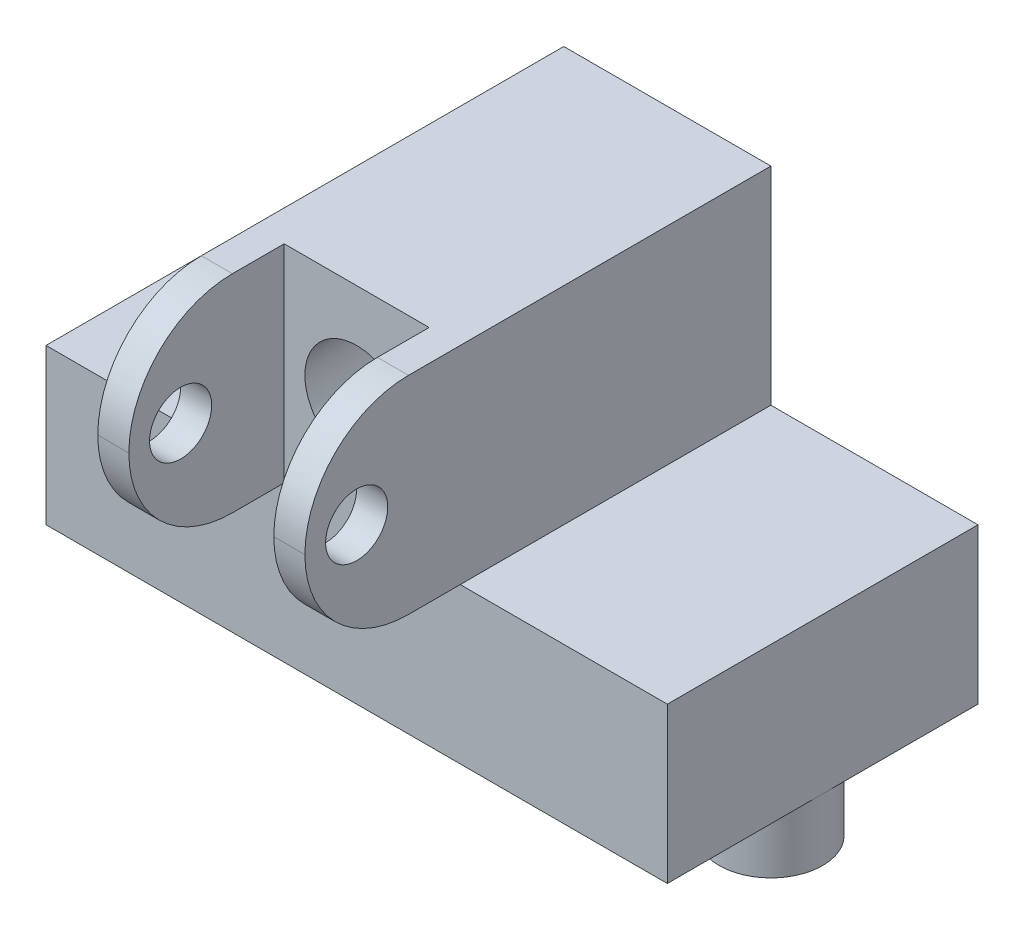
ISO-10303-21;
HEADER;
FILE_DESCRIPTION(('STEP AP214'),'2;1');
FILE_NAME('part.step','',(''),(''),'','','');
FILE_SCHEMA(('AUTOMOTIVE_DESIGN { 1 0 10303 214 1 1 1 1 }'));
ENDSEC;
DATA;
#1=APPLICATION_CONTEXT('core data for automotive mechanical design processes');
#2=APPLICATION_PROTOCOL_DEFINITION('international standard','automotive_design',2000,#1);
#3=PRODUCT_CONTEXT('',#1,'mechanical');
#4=PRODUCT('Part','Part','',(#3));
#5=PRODUCT_RELATED_PRODUCT_CATEGORY('part','',(#4));
#6=PRODUCT_DEFINITION_FORMATION('','',#4);
#7=PRODUCT_DEFINITION_CONTEXT('part definition',#1,'design');
#8=PRODUCT_DEFINITION('design','',#6,#7);
#9=PRODUCT_DEFINITION_SHAPE('','',#8);
#10=(LENGTH_UNIT() NAMED_UNIT(*) SI_UNIT(.MILLI.,.METRE.));
#11=(NAMED_UNIT(*) PLANE_ANGLE_UNIT() SI_UNIT($,.RADIAN.));
#12=(NAMED_UNIT(*) SI_UNIT($,.STERADIAN.) SOLID_ANGLE_UNIT());
#13=UNCERTAINTY_MEASURE_WITH_UNIT(LENGTH_MEASURE(1.E-05),#10,'distance_accuracy_value','');
#14=(GEOMETRIC_REPRESENTATION_CONTEXT(3) GLOBAL_UNCERTAINTY_ASSIGNED_CONTEXT((#13)) GLOBAL_UNIT_ASSIGNED_CONTEXT((#10,
#11,#12)) REPRESENTATION_CONTEXT('',''));
#15=CARTESIAN_POINT('',(0.,0.,0.));
#16=DIRECTION('',(0.,0.,1.));
#17=DIRECTION('',(1.,0.,0.));
#18=AXIS2_PLACEMENT_3D('',#15,#16,#17);
#19=CARTESIAN_POINT('',(0.,25.,20.));
#20=DIRECTION('',(-1.,0.,0.));
#21=DIRECTION('',(0.,0.,1.));
#22=AXIS2_PLACEMENT_3D('',#19,#20,#21);
#23=CYLINDRICAL_SURFACE('',#22,10.);
#24=DIRECTION('',(1.,0.,0.));
#25=VECTOR('',#24,1.);
#26=CARTESIAN_POINT('',(0.,35.,20.));
#27=LINE('',#26,#25);
#28=CARTESIAN_POINT('',(-15.,35.,20.));
#29=VERTEX_POINT('',#28);
#30=CARTESIAN_POINT('',(-12.,35.,20.));
#31=VERTEX_POINT('',#30);
#32=EDGE_CURVE('E287',#29,#31,#27,.T.);
#33=ORIENTED_EDGE('',*,*,#32,.F.);
#34=CARTESIAN_POINT('',(-15.,25.,20.));
#35=DIRECTION('',(1.,0.,0.));
#36=DIRECTION('',(0.,0.,-1.));
#37=AXIS2_PLACEMENT_3D('',#34,#35,#36);
#38=CIRCLE('',#37,10.);
#39=CARTESIAN_POINT('',(-15.,25.,30.));
#40=VERTEX_POINT('',#39);
#41=EDGE_CURVE('E40',#40,#29,#38,.F.);
#42=ORIENTED_EDGE('',*,*,#41,.F.);
#43=DIRECTION('',(-1.,0.,0.));
#44=VECTOR('',#43,1.);
#45=CARTESIAN_POINT('',(0.,25.,30.));
#46=LINE('',#45,#44);
#47=CARTESIAN_POINT('',(-12.,25.,30.));
#48=VERTEX_POINT('',#47);
#49=EDGE_CURVE('E299',#40,#48,#46,.F.);
#50=ORIENTED_EDGE('',*,*,#49,.T.);
#51=CARTESIAN_POINT('',(-12.,25.,20.));
#52=DIRECTION('',(-1.,0.,0.));
#53=DIRECTION('',(0.,0.,1.));
#54=AXIS2_PLACEMENT_3D('',#51,#52,#53);
#55=CIRCLE('',#54,10.);
#56=EDGE_CURVE('E11',#31,#48,#55,.F.);
#57=ORIENTED_EDGE('',*,*,#56,.F.);
#58=EDGE_LOOP('',(#33,#42,#50,#57));
#59=FACE_BOUND('',#58,.T.);
#60=ADVANCED_FACE('F32',(#59),#23,.T.);
#61=CARTESIAN_POINT('',(-15.,25.,20.));
#62=DIRECTION('',(-1.,0.,0.));
#63=DIRECTION('',(0.,0.,1.));
#64=AXIS2_PLACEMENT_3D('',#61,#62,#63);
#65=CYLINDRICAL_SURFACE('',#64,10.);
#66=DIRECTION('',(-1.,0.,0.));
#67=VECTOR('',#66,1.);
#68=CARTESIAN_POINT('',(-15.,15.,20.));
#69=LINE('',#68,#67);
#70=CARTESIAN_POINT('',(-12.,15.,20.));
#71=VERTEX_POINT('',#70);
#72=CARTESIAN_POINT('',(-15.,15.,20.));
#73=VERTEX_POINT('',#72);
#74=EDGE_CURVE('E190',#71,#73,#69,.T.);
#75=ORIENTED_EDGE('',*,*,#74,.F.);
#76=CARTESIAN_POINT('',(-12.,25.,20.));
#77=DIRECTION('',(-1.,0.,0.));
#78=DIRECTION('',(0.,0.,1.));
#79=AXIS2_PLACEMENT_3D('',#76,#77,#78);
#80=CIRCLE('',#79,10.);
#81=EDGE_CURVE('E298',#48,#71,#80,.F.);
#82=ORIENTED_EDGE('',*,*,#81,.F.);
#83=ORIENTED_EDGE('',*,*,#49,.F.);
#84=CARTESIAN_POINT('',(-15.,25.,20.));
#85=DIRECTION('',(1.,0.,0.));
#86=DIRECTION('',(0.,0.,-1.));
#87=AXIS2_PLACEMENT_3D('',#84,#85,#86);
#88=CIRCLE('',#87,10.);
#89=EDGE_CURVE('E289',#73,#40,#88,.F.);
#90=ORIENTED_EDGE('',*,*,#89,.F.);
#91=EDGE_LOOP('',(#75,#82,#83,#90));
#92=FACE_BOUND('',#91,.T.);
#93=ADVANCED_FACE('F303',(#92),#65,.T.);
#94=CARTESIAN_POINT('',(0.,25.,20.));
#95=DIRECTION('',(1.,0.,0.));
#96=DIRECTION('',(0.,0.,-1.));
#97=AXIS2_PLACEMENT_3D('',#94,#95,#96);
#98=CYLINDRICAL_SURFACE('',#97,10.);
#99=DIRECTION('',(1.,0.,0.));
#100=VECTOR('',#99,1.);
#101=CARTESIAN_POINT('',(0.,25.,30.));
#102=LINE('',#101,#100);
#103=CARTESIAN_POINT('',(5.00000000000001,25.,30.));
#104=VERTEX_POINT('',#103);
#105=CARTESIAN_POINT('',(2.00000000000001,25.,30.));
#106=VERTEX_POINT('',#105);
#107=EDGE_CURVE('E615',#104,#106,#102,.F.);
#108=ORIENTED_EDGE('',*,*,#107,.T.);
#109=CARTESIAN_POINT('',(2.00000000000001,25.,20.));
#110=DIRECTION('',(1.,0.,0.));
#111=DIRECTION('',(0.,0.,-1.));
#112=AXIS2_PLACEMENT_3D('',#109,#110,#111);
#113=CIRCLE('',#112,10.);
#114=CARTESIAN_POINT('',(2.00000000000001,15.,20.));
#115=VERTEX_POINT('',#114);
#116=EDGE_CURVE('E186',#115,#106,#113,.F.);
#117=ORIENTED_EDGE('',*,*,#116,.F.);
#118=DIRECTION('',(1.,0.,0.));
#119=VECTOR('',#118,1.);
#120=CARTESIAN_POINT('',(2.00000000000001,15.,20.));
#121=LINE('',#120,#119);
#122=CARTESIAN_POINT('',(5.00000000000001,15.,20.));
#123=VERTEX_POINT('',#122);
#124=EDGE_CURVE('E149',#123,#115,#121,.F.);
#125=ORIENTED_EDGE('',*,*,#124,.F.);
#126=CARTESIAN_POINT('',(5.00000000000001,25.,20.));
#127=DIRECTION('',(-1.,0.,0.));
#128=DIRECTION('',(0.,0.,1.));
#129=AXIS2_PLACEMENT_3D('',#126,#127,#128);
#130=CIRCLE('',#129,10.);
#131=EDGE_CURVE('E188',#104,#123,#130,.F.);
#132=ORIENTED_EDGE('',*,*,#131,.F.);
#133=EDGE_LOOP('',(#108,#117,#125,#132));
#134=FACE_BOUND('',#133,.T.);
#135=ADVANCED_FACE('F305',(#134),#98,.T.);
#136=CARTESIAN_POINT('',(0.,25.,20.));
#137=DIRECTION('',(-1.,0.,0.));
#138=DIRECTION('',(0.,0.,1.));
#139=AXIS2_PLACEMENT_3D('',#136,#137,#138);
#140=CYLINDRICAL_SURFACE('',#139,10.);
#141=DIRECTION('',(1.,0.,0.));
#142=VECTOR('',#141,1.);
#143=CARTESIAN_POINT('',(0.,35.,20.));
#144=LINE('',#143,#142);
#145=CARTESIAN_POINT('',(2.00000000000001,35.,20.));
#146=VERTEX_POINT('',#145);
#147=CARTESIAN_POINT('',(5.00000000000001,35.,20.));
#148=VERTEX_POINT('',#147);
#149=EDGE_CURVE('E178',#146,#148,#144,.T.);
#150=ORIENTED_EDGE('',*,*,#149,.F.);
#151=CARTESIAN_POINT('',(2.00000000000001,25.,20.));
#152=DIRECTION('',(1.,0.,0.));
#153=DIRECTION('',(0.,0.,-1.));
#154=AXIS2_PLACEMENT_3D('',#151,#152,#153);
#155=CIRCLE('',#154,10.);
#156=EDGE_CURVE('E617',#106,#146,#155,.F.);
#157=ORIENTED_EDGE('',*,*,#156,.F.);
#158=ORIENTED_EDGE('',*,*,#107,.F.);
#159=CARTESIAN_POINT('',(5.00000000000001,25.,20.));
#160=DIRECTION('',(-1.,0.,0.));
#161=DIRECTION('',(0.,0.,1.));
#162=AXIS2_PLACEMENT_3D('',#159,#160,#161);
#163=CIRCLE('',#162,10.);
#164=EDGE_CURVE('E183',#148,#104,#163,.F.);
#165=ORIENTED_EDGE('',*,*,#164,.F.);
#166=EDGE_LOOP('',(#150,#157,#158,#165));
#167=FACE_BOUND('',#166,.T.);
#168=ADVANCED_FACE('F310',(#167),#140,.T.);
#169=CARTESIAN_POINT('',(25.,15.,15.));
#170=DIRECTION('',(0.,0.,-1.));
#171=DIRECTION('',(-1.,0.,0.));
#172=AXIS2_PLACEMENT_3D('',#169,#170,#171);
#173=PLANE('',#172);
#174=CARTESIAN_POINT('',(-4.99999999999999,25.,15.));
#175=DIRECTION('',(0.,0.,-1.));
#176=DIRECTION('',(-1.,0.,0.));
#177=AXIS2_PLACEMENT_3D('',#174,#175,#176);
#178=CIRCLE('',#177,5.);
#179=CARTESIAN_POINT('',(-9.99999999999998,25.,15.));
#180=VERTEX_POINT('',#179);
#181=EDGE_CURVE('E208',#180,#180,#178,.T.);
#182=ORIENTED_EDGE('',*,*,#181,.T.);
#183=EDGE_LOOP('',(#182));
#184=FACE_BOUND('',#183,.T.);
#185=DIRECTION('',(0.,-1.,0.));
#186=VECTOR('',#185,1.);
#187=CARTESIAN_POINT('',(2.00000000000001,15.,15.));
#188=LINE('',#187,#186);
#189=CARTESIAN_POINT('',(2.00000000000001,35.,15.));
#190=VERTEX_POINT('',#189);
#191=CARTESIAN_POINT('',(2.00000000000001,15.,15.));
#192=VERTEX_POINT('',#191);
#193=EDGE_CURVE('E155',#190,#192,#188,.T.);
#194=ORIENTED_EDGE('',*,*,#193,.F.);
#195=DIRECTION('',(1.,0.,0.));
#196=VECTOR('',#195,1.);
#197=CARTESIAN_POINT('',(-15.,35.,15.));
#198=LINE('',#197,#196);
#199=CARTESIAN_POINT('',(-12.,35.,15.));
#200=VERTEX_POINT('',#199);
#201=EDGE_CURVE('E220',#200,#190,#198,.T.);
#202=ORIENTED_EDGE('',*,*,#201,.F.);
#203=DIRECTION('',(0.,1.,0.));
#204=VECTOR('',#203,1.);
#205=CARTESIAN_POINT('',(-12.,15.,15.));
#206=LINE('',#205,#204);
#207=CARTESIAN_POINT('',(-12.,15.,15.));
#208=VERTEX_POINT('',#207);
#209=EDGE_CURVE('E201',#208,#200,#206,.T.);
#210=ORIENTED_EDGE('',*,*,#209,.F.);
#211=DIRECTION('',(1.,0.,0.));
#212=VECTOR('',#211,1.);
#213=CARTESIAN_POINT('',(-15.,15.,15.));
#214=LINE('',#213,#212);
#215=CARTESIAN_POINT('',(-15.,15.,15.));
#216=VERTEX_POINT('',#215);
#217=EDGE_CURVE('E151',#216,#208,#214,.T.);
#218=ORIENTED_EDGE('',*,*,#217,.F.);
#219=DIRECTION('',(1.,0.,0.));
#220=VECTOR('',#219,1.);
#221=CARTESIAN_POINT('',(25.,15.,15.));
#222=LINE('',#221,#220);
#223=CARTESIAN_POINT('',(-35.,15.,15.));
#224=VERTEX_POINT('',#223);
#225=EDGE_CURVE('E239',#224,#216,#222,.T.);
#226=ORIENTED_EDGE('',*,*,#225,.F.);
#227=DIRECTION('',(0.,-1.,0.));
#228=VECTOR('',#227,1.);
#229=CARTESIAN_POINT('',(-35.,15.,15.));
#230=LINE('',#229,#228);
#231=CARTESIAN_POINT('',(-35.,0.,15.));
#232=VERTEX_POINT('',#231);
#233=EDGE_CURVE('E593',#224,#232,#230,.T.);
#234=ORIENTED_EDGE('',*,*,#233,.T.);
#235=DIRECTION('',(1.,0.,0.));
#236=VECTOR('',#235,1.);
#237=CARTESIAN_POINT('',(25.,0.,15.));
#238=LINE('',#237,#236);
#239=CARTESIAN_POINT('',(25.,0.,15.));
#240=VERTEX_POINT('',#239);
#241=EDGE_CURVE('E581',#232,#240,#238,.T.);
#242=ORIENTED_EDGE('',*,*,#241,.T.);
#243=DIRECTION('',(0.,-1.,0.));
#244=VECTOR('',#243,1.);
#245=CARTESIAN_POINT('',(25.,15.,15.));
#246=LINE('',#245,#244);
#247=CARTESIAN_POINT('',(25.,15.,15.));
#248=VERTEX_POINT('',#247);
#249=EDGE_CURVE('E590',#248,#240,#246,.T.);
#250=ORIENTED_EDGE('',*,*,#249,.F.);
#251=CARTESIAN_POINT('',(5.00000000000001,15.,15.));
#252=VERTEX_POINT('',#251);
#253=EDGE_CURVE('E167',#252,#248,#222,.T.);
#254=ORIENTED_EDGE('',*,*,#253,.F.);
#255=DIRECTION('',(1.,0.,0.));
#256=VECTOR('',#255,1.);
#257=CARTESIAN_POINT('',(2.00000000000001,15.,15.));
#258=LINE('',#257,#256);
#259=EDGE_CURVE('E146',#192,#252,#258,.T.);
#260=ORIENTED_EDGE('',*,*,#259,.F.);
#261=EDGE_LOOP('',(#194,#202,#210,#218,#226,#234,#242,#250,#254,#260));
#262=FACE_BOUND('',#261,.T.);
#263=ADVANCED_FACE('F165',(#184,#262),#173,.F.);
#264=CARTESIAN_POINT('',(0.,15.,0.));
#265=DIRECTION('',(0.,1.,0.));
#266=DIRECTION('',(0.,0.,1.));
#267=AXIS2_PLACEMENT_3D('',#264,#265,#266);
#268=PLANE('',#267);
#269=DIRECTION('',(0.,0.,-1.));
#270=VECTOR('',#269,1.);
#271=CARTESIAN_POINT('',(5.00000000000001,15.,15.));
#272=LINE('',#271,#270);
#273=CARTESIAN_POINT('',(5.00000000000001,15.,-15.));
#274=VERTEX_POINT('',#273);
#275=EDGE_CURVE('E217',#252,#274,#272,.T.);
#276=ORIENTED_EDGE('',*,*,#275,.F.);
#277=ORIENTED_EDGE('',*,*,#253,.T.);
#278=DIRECTION('',(0.,0.,-1.));
#279=VECTOR('',#278,1.);
#280=CARTESIAN_POINT('',(25.,15.,15.));
#281=LINE('',#280,#279);
#282=CARTESIAN_POINT('',(25.,15.,-15.));
#283=VERTEX_POINT('',#282);
#284=EDGE_CURVE('E248',#248,#283,#281,.T.);
#285=ORIENTED_EDGE('',*,*,#284,.T.);
#286=DIRECTION('',(-1.,0.,0.));
#287=VECTOR('',#286,1.);
#288=CARTESIAN_POINT('',(25.,15.,-15.));
#289=LINE('',#288,#287);
#290=EDGE_CURVE('E564',#283,#274,#289,.T.);
#291=ORIENTED_EDGE('',*,*,#290,.T.);
#292=EDGE_LOOP('',(#276,#277,#285,#291));
#293=FACE_BOUND('',#292,.T.);
#294=ADVANCED_FACE('F325',(#293),#268,.T.);
#295=CARTESIAN_POINT('',(0.,0.,0.));
#296=DIRECTION('',(0.,1.,0.));
#297=DIRECTION('',(0.,0.,1.));
#298=AXIS2_PLACEMENT_3D('',#295,#296,#297);
#299=PLANE('',#298);
#300=CARTESIAN_POINT('',(-20.,0.,0.));
#301=DIRECTION('',(0.,1.,0.));
#302=DIRECTION('',(0.,0.,1.));
#303=AXIS2_PLACEMENT_3D('',#300,#301,#302);
#304=CIRCLE('',#303,5.);
#305=CARTESIAN_POINT('',(-20.,0.,5.));
#306=VERTEX_POINT('',#305);
#307=EDGE_CURVE('E595',#306,#306,#304,.F.);
#308=ORIENTED_EDGE('',*,*,#307,.F.);
#309=EDGE_LOOP('',(#308));
#310=FACE_BOUND('',#309,.T.);
#311=DIRECTION('',(0.,0.,-1.));
#312=VECTOR('',#311,1.);
#313=CARTESIAN_POINT('',(25.,0.,15.));
#314=LINE('',#313,#312);
#315=CARTESIAN_POINT('',(25.,0.,0.));
#316=VERTEX_POINT('',#315);
#317=CARTESIAN_POINT('',(25.,0.,-15.));
#318=VERTEX_POINT('',#317);
#319=EDGE_CURVE('E584',#316,#318,#314,.T.);
#320=ORIENTED_EDGE('',*,*,#319,.F.);
#321=CARTESIAN_POINT('',(20.,0.,0.));
#322=DIRECTION('',(0.,-1.,0.));
#323=DIRECTION('',(0.,0.,1.));
#324=AXIS2_PLACEMENT_3D('',#321,#322,#323);
#325=CIRCLE('',#324,5.);
#326=EDGE_CURVE('E276',#316,#316,#325,.T.);
#327=ORIENTED_EDGE('',*,*,#326,.F.);
#328=EDGE_CURVE('E585',#240,#316,#314,.T.);
#329=ORIENTED_EDGE('',*,*,#328,.F.);
#330=ORIENTED_EDGE('',*,*,#241,.F.);
#331=DIRECTION('',(0.,0.,1.));
#332=VECTOR('',#331,1.);
#333=CARTESIAN_POINT('',(-35.,0.,15.));
#334=LINE('',#333,#332);
#335=CARTESIAN_POINT('',(-35.,0.,-15.));
#336=VERTEX_POINT('',#335);
#337=EDGE_CURVE('E577',#336,#232,#334,.T.);
#338=ORIENTED_EDGE('',*,*,#337,.F.);
#339=DIRECTION('',(-1.,0.,0.));
#340=VECTOR('',#339,1.);
#341=CARTESIAN_POINT('',(25.,0.,-15.));
#342=LINE('',#341,#340);
#343=EDGE_CURVE('E587',#318,#336,#342,.T.);
#344=ORIENTED_EDGE('',*,*,#343,.F.);
#345=EDGE_LOOP('',(#320,#327,#329,#330,#338,#344));
#346=FACE_BOUND('',#345,.T.);
#347=ADVANCED_FACE('F321',(#310,#346),#299,.F.);
#348=CARTESIAN_POINT('',(-35.,15.,15.));
#349=DIRECTION('',(1.,0.,0.));
#350=DIRECTION('',(0.,0.,-1.));
#351=AXIS2_PLACEMENT_3D('',#348,#349,#350);
#352=PLANE('',#351);
#353=ORIENTED_EDGE('',*,*,#337,.T.);
#354=ORIENTED_EDGE('',*,*,#233,.F.);
#355=DIRECTION('',(0.,0.,1.));
#356=VECTOR('',#355,1.);
#357=CARTESIAN_POINT('',(-35.,15.,15.));
#358=LINE('',#357,#356);
#359=CARTESIAN_POINT('',(-35.,15.,-15.));
#360=VERTEX_POINT('',#359);
#361=EDGE_CURVE('E246',#360,#224,#358,.T.);
#362=ORIENTED_EDGE('',*,*,#361,.F.);
#363=DIRECTION('',(0.,-1.,0.));
#364=VECTOR('',#363,1.);
#365=CARTESIAN_POINT('',(-35.,15.,-15.));
#366=LINE('',#365,#364);
#367=EDGE_CURVE('E568',#360,#336,#366,.T.);
#368=ORIENTED_EDGE('',*,*,#367,.T.);
#369=EDGE_LOOP('',(#353,#354,#362,#368));
#370=FACE_BOUND('',#369,.T.);
#371=ADVANCED_FACE('F317',(#370),#352,.F.);
#372=CARTESIAN_POINT('',(25.,15.,15.));
#373=DIRECTION('',(-1.,0.,0.));
#374=DIRECTION('',(0.,0.,1.));
#375=AXIS2_PLACEMENT_3D('',#372,#373,#374);
#376=PLANE('',#375);
#377=ORIENTED_EDGE('',*,*,#328,.T.);
#378=ORIENTED_EDGE('',*,*,#319,.T.);
#379=DIRECTION('',(0.,-1.,0.));
#380=VECTOR('',#379,1.);
#381=CARTESIAN_POINT('',(25.,15.,-15.));
#382=LINE('',#381,#380);
#383=EDGE_CURVE('E570',#283,#318,#382,.T.);
#384=ORIENTED_EDGE('',*,*,#383,.F.);
#385=ORIENTED_EDGE('',*,*,#284,.F.);
#386=ORIENTED_EDGE('',*,*,#249,.T.);
#387=EDGE_LOOP('',(#377,#378,#384,#385,#386));
#388=FACE_BOUND('',#387,.T.);
#389=ADVANCED_FACE('F320',(#388),#376,.F.);
#390=CARTESIAN_POINT('',(25.,15.,-15.));
#391=DIRECTION('',(0.,0.,1.));
#392=DIRECTION('',(1.,0.,0.));
#393=AXIS2_PLACEMENT_3D('',#390,#391,#392);
#394=PLANE('',#393);
#395=CARTESIAN_POINT('',(-4.99999999999999,25.,-15.));
#396=DIRECTION('',(0.,0.,-1.));
#397=DIRECTION('',(-1.,0.,0.));
#398=AXIS2_PLACEMENT_3D('',#395,#396,#397);
#399=CIRCLE('',#398,5.);
#400=CARTESIAN_POINT('',(-9.99999999999999,25.,-15.));
#401=VERTEX_POINT('',#400);
#402=EDGE_CURVE('E194',#401,#401,#399,.T.);
#403=ORIENTED_EDGE('',*,*,#402,.F.);
#404=EDGE_LOOP('',(#403));
#405=FACE_BOUND('',#404,.T.);
#406=ORIENTED_EDGE('',*,*,#343,.T.);
#407=ORIENTED_EDGE('',*,*,#367,.F.);
#408=CARTESIAN_POINT('',(-15.,15.,-15.));
#409=VERTEX_POINT('',#408);
#410=EDGE_CURVE('E259',#409,#360,#289,.T.);
#411=ORIENTED_EDGE('',*,*,#410,.F.);
#412=DIRECTION('',(0.,-1.,0.));
#413=VECTOR('',#412,1.);
#414=CARTESIAN_POINT('',(-15.,35.,-15.));
#415=LINE('',#414,#413);
#416=CARTESIAN_POINT('',(-15.,35.,-15.));
#417=VERTEX_POINT('',#416);
#418=EDGE_CURVE('E253',#417,#409,#415,.T.);
#419=ORIENTED_EDGE('',*,*,#418,.F.);
#420=DIRECTION('',(-1.,0.,0.));
#421=VECTOR('',#420,1.);
#422=CARTESIAN_POINT('',(5.00000000000001,35.,-15.));
#423=LINE('',#422,#421);
#424=CARTESIAN_POINT('',(5.00000000000001,35.,-15.));
#425=VERTEX_POINT('',#424);
#426=EDGE_CURVE('E214',#425,#417,#423,.T.);
#427=ORIENTED_EDGE('',*,*,#426,.F.);
#428=DIRECTION('',(0.,-1.,0.));
#429=VECTOR('',#428,1.);
#430=CARTESIAN_POINT('',(5.00000000000001,35.,-15.));
#431=LINE('',#430,#429);
#432=EDGE_CURVE('E270',#425,#274,#431,.T.);
#433=ORIENTED_EDGE('',*,*,#432,.T.);
#434=ORIENTED_EDGE('',*,*,#290,.F.);
#435=ORIENTED_EDGE('',*,*,#383,.T.);
#436=EDGE_LOOP('',(#406,#407,#411,#419,#427,#433,#434,#435));
#437=FACE_BOUND('',#436,.T.);
#438=ADVANCED_FACE('F285',(#405,#437),#394,.F.);
#439=DIRECTION('',(0.,0.,1.));
#440=VECTOR('',#439,1.);
#441=CARTESIAN_POINT('',(-15.,15.,-15.));
#442=LINE('',#441,#440);
#443=EDGE_CURVE('E211',#409,#216,#442,.T.);
#444=ORIENTED_EDGE('',*,*,#443,.F.);
#445=ORIENTED_EDGE('',*,*,#410,.T.);
#446=ORIENTED_EDGE('',*,*,#361,.T.);
#447=ORIENTED_EDGE('',*,*,#225,.T.);
#448=EDGE_LOOP('',(#444,#445,#446,#447));
#449=FACE_BOUND('',#448,.T.);
#450=ADVANCED_FACE('F243',(#449),#268,.T.);
#451=CARTESIAN_POINT('',(-20.,-6.,0.));
#452=DIRECTION('',(0.,1.,0.));
#453=DIRECTION('',(0.,0.,1.));
#454=AXIS2_PLACEMENT_3D('',#451,#452,#453);
#455=CYLINDRICAL_SURFACE('',#454,5.);
#456=CARTESIAN_POINT('',(-20.,-6.,0.));
#457=DIRECTION('',(0.,-1.,0.));
#458=DIRECTION('',(0.,0.,-1.));
#459=AXIS2_PLACEMENT_3D('',#456,#457,#458);
#460=CIRCLE('',#459,5.);
#461=CARTESIAN_POINT('',(-20.,-6.,-5.));
#462=VERTEX_POINT('',#461);
#463=EDGE_CURVE('E582',#462,#462,#460,.T.);
#464=ORIENTED_EDGE('',*,*,#463,.F.);
#465=EDGE_LOOP('',(#464));
#466=FACE_BOUND('',#465,.T.);
#467=ORIENTED_EDGE('',*,*,#307,.T.);
#468=EDGE_LOOP('',(#467));
#469=FACE_BOUND('',#468,.T.);
#470=ADVANCED_FACE('F338',(#466,#469),#455,.T.);
#471=CARTESIAN_POINT('',(-20.,-6.,0.));
#472=DIRECTION('',(0.,-1.,0.));
#473=DIRECTION('',(0.,0.,-1.));
#474=AXIS2_PLACEMENT_3D('',#471,#472,#473);
#475=PLANE('',#474);
#476=ORIENTED_EDGE('',*,*,#463,.T.);
#477=EDGE_LOOP('',(#476));
#478=FACE_BOUND('',#477,.T.);
#479=ADVANCED_FACE('F341',(#478),#475,.T.);
#480=CARTESIAN_POINT('',(20.,-6.,0.));
#481=DIRECTION('',(0.,1.,0.));
#482=DIRECTION('',(0.,0.,1.));
#483=AXIS2_PLACEMENT_3D('',#480,#481,#482);
#484=CYLINDRICAL_SURFACE('',#483,5.);
#485=CARTESIAN_POINT('',(20.,-6.,0.));
#486=DIRECTION('',(0.,-1.,0.));
#487=DIRECTION('',(0.,0.,1.));
#488=AXIS2_PLACEMENT_3D('',#485,#486,#487);
#489=CIRCLE('',#488,5.);
#490=CARTESIAN_POINT('',(20.,-6.,5.));
#491=VERTEX_POINT('',#490);
#492=EDGE_CURVE('E267',#491,#491,#489,.T.);
#493=ORIENTED_EDGE('',*,*,#492,.F.);
#494=EDGE_LOOP('',(#493));
#495=FACE_BOUND('',#494,.T.);
#496=ORIENTED_EDGE('',*,*,#326,.T.);
#497=EDGE_LOOP('',(#496));
#498=FACE_BOUND('',#497,.T.);
#499=ADVANCED_FACE('F345',(#495,#498),#484,.T.);
#500=CARTESIAN_POINT('',(20.,-6.,0.));
#501=DIRECTION('',(0.,1.,0.));
#502=DIRECTION('',(0.,0.,1.));
#503=AXIS2_PLACEMENT_3D('',#500,#501,#502);
#504=PLANE('',#503);
#505=ORIENTED_EDGE('',*,*,#492,.T.);
#506=EDGE_LOOP('',(#505));
#507=FACE_BOUND('',#506,.T.);
#508=ADVANCED_FACE('F349',(#507),#504,.F.);
#509=CARTESIAN_POINT('',(-15.,35.,-15.));
#510=DIRECTION('',(1.,0.,0.));
#511=DIRECTION('',(0.,0.,-1.));
#512=AXIS2_PLACEMENT_3D('',#509,#510,#511);
#513=PLANE('',#512);
#514=CARTESIAN_POINT('',(-15.,25.,25.));
#515=DIRECTION('',(-1.,0.,0.));
#516=DIRECTION('',(0.,0.,1.));
#517=AXIS2_PLACEMENT_3D('',#514,#515,#516);
#518=CIRCLE('',#517,3.);
#519=CARTESIAN_POINT('',(-15.,25.,28.));
#520=VERTEX_POINT('',#519);
#521=EDGE_CURVE('E394',#520,#520,#518,.T.);
#522=ORIENTED_EDGE('',*,*,#521,.F.);
#523=EDGE_LOOP('',(#522));
#524=FACE_BOUND('',#523,.T.);
#525=ORIENTED_EDGE('',*,*,#89,.T.);
#526=ORIENTED_EDGE('',*,*,#41,.T.);
#527=DIRECTION('',(0.,0.,1.));
#528=VECTOR('',#527,1.);
#529=CARTESIAN_POINT('',(-15.,35.,-15.));
#530=LINE('',#529,#528);
#531=EDGE_CURVE('E216',#417,#29,#530,.T.);
#532=ORIENTED_EDGE('',*,*,#531,.F.);
#533=ORIENTED_EDGE('',*,*,#418,.T.);
#534=ORIENTED_EDGE('',*,*,#443,.T.);
#535=DIRECTION('',(0.,0.,-1.));
#536=VECTOR('',#535,1.);
#537=CARTESIAN_POINT('',(-15.,15.,30.));
#538=LINE('',#537,#536);
#539=EDGE_CURVE('E191',#73,#216,#538,.T.);
#540=ORIENTED_EDGE('',*,*,#539,.F.);
#541=EDGE_LOOP('',(#525,#526,#532,#533,#534,#540));
#542=FACE_BOUND('',#541,.T.);
#543=ADVANCED_FACE('F251',(#524,#542),#513,.F.);
#544=CARTESIAN_POINT('',(5.00000000000001,35.,15.));
#545=DIRECTION('',(-1.,0.,0.));
#546=DIRECTION('',(0.,0.,1.));
#547=AXIS2_PLACEMENT_3D('',#544,#545,#546);
#548=PLANE('',#547);
#549=CARTESIAN_POINT('',(5.00000000000001,25.,25.));
#550=DIRECTION('',(-1.,0.,0.));
#551=DIRECTION('',(0.,0.,1.));
#552=AXIS2_PLACEMENT_3D('',#549,#550,#551);
#553=CIRCLE('',#552,3.);
#554=CARTESIAN_POINT('',(5.00000000000001,25.,28.));
#555=VERTEX_POINT('',#554);
#556=EDGE_CURVE('E162',#555,#555,#553,.T.);
#557=ORIENTED_EDGE('',*,*,#556,.T.);
#558=EDGE_LOOP('',(#557));
#559=FACE_BOUND('',#558,.T.);
#560=ORIENTED_EDGE('',*,*,#164,.T.);
#561=ORIENTED_EDGE('',*,*,#131,.T.);
#562=DIRECTION('',(0.,0.,-1.));
#563=VECTOR('',#562,1.);
#564=CARTESIAN_POINT('',(5.00000000000001,15.,30.));
#565=LINE('',#564,#563);
#566=EDGE_CURVE('E152',#123,#252,#565,.T.);
#567=ORIENTED_EDGE('',*,*,#566,.T.);
#568=ORIENTED_EDGE('',*,*,#275,.T.);
#569=ORIENTED_EDGE('',*,*,#432,.F.);
#570=DIRECTION('',(0.,0.,-1.));
#571=VECTOR('',#570,1.);
#572=CARTESIAN_POINT('',(5.00000000000001,35.,15.));
#573=LINE('',#572,#571);
#574=EDGE_CURVE('E223',#148,#425,#573,.T.);
#575=ORIENTED_EDGE('',*,*,#574,.F.);
#576=EDGE_LOOP('',(#560,#561,#567,#568,#569,#575));
#577=FACE_BOUND('',#576,.T.);
#578=ADVANCED_FACE('F284',(#559,#577),#548,.F.);
#579=CARTESIAN_POINT('',(0.,35.,0.));
#580=DIRECTION('',(0.,1.,0.));
#581=DIRECTION('',(0.,0.,1.));
#582=AXIS2_PLACEMENT_3D('',#579,#580,#581);
#583=PLANE('',#582);
#584=ORIENTED_EDGE('',*,*,#531,.T.);
#585=ORIENTED_EDGE('',*,*,#32,.T.);
#586=DIRECTION('',(0.,0.,-1.));
#587=VECTOR('',#586,1.);
#588=CARTESIAN_POINT('',(-12.,35.,30.));
#589=LINE('',#588,#587);
#590=EDGE_CURVE('E204',#31,#200,#589,.T.);
#591=ORIENTED_EDGE('',*,*,#590,.T.);
#592=ORIENTED_EDGE('',*,*,#201,.T.);
#593=DIRECTION('',(0.,0.,-1.));
#594=VECTOR('',#593,1.);
#595=CARTESIAN_POINT('',(2.00000000000001,35.,30.));
#596=LINE('',#595,#594);
#597=EDGE_CURVE('E158',#146,#190,#596,.T.);
#598=ORIENTED_EDGE('',*,*,#597,.F.);
#599=ORIENTED_EDGE('',*,*,#149,.T.);
#600=ORIENTED_EDGE('',*,*,#574,.T.);
#601=ORIENTED_EDGE('',*,*,#426,.T.);
#602=EDGE_LOOP('',(#584,#585,#591,#592,#598,#599,#600,#601));
#603=FACE_BOUND('',#602,.T.);
#604=ADVANCED_FACE('F280',(#603),#583,.T.);
#605=CARTESIAN_POINT('',(-4.99999999999999,25.,15.));
#606=DIRECTION('',(0.,0.,-1.));
#607=DIRECTION('',(-1.,0.,0.));
#608=AXIS2_PLACEMENT_3D('',#605,#606,#607);
#609=CYLINDRICAL_SURFACE('',#608,5.);
#610=ORIENTED_EDGE('',*,*,#181,.F.);
#611=EDGE_LOOP('',(#610));
#612=FACE_BOUND('',#611,.T.);
#613=ORIENTED_EDGE('',*,*,#402,.T.);
#614=EDGE_LOOP('',(#613));
#615=FACE_BOUND('',#614,.T.);
#616=ADVANCED_FACE('F362',(#612,#615),#609,.F.);
#617=CARTESIAN_POINT('',(-15.,15.,30.));
#618=DIRECTION('',(0.,1.,0.));
#619=DIRECTION('',(0.,0.,1.));
#620=AXIS2_PLACEMENT_3D('',#617,#618,#619);
#621=PLANE('',#620);
#622=DIRECTION('',(0.,0.,-1.));
#623=VECTOR('',#622,1.);
#624=CARTESIAN_POINT('',(-12.,15.,30.));
#625=LINE('',#624,#623);
#626=EDGE_CURVE('E195',#71,#208,#625,.T.);
#627=ORIENTED_EDGE('',*,*,#626,.F.);
#628=ORIENTED_EDGE('',*,*,#74,.T.);
#629=ORIENTED_EDGE('',*,*,#539,.T.);
#630=ORIENTED_EDGE('',*,*,#217,.T.);
#631=EDGE_LOOP('',(#627,#628,#629,#630));
#632=FACE_BOUND('',#631,.T.);
#633=ADVANCED_FACE('F233',(#632),#621,.F.);
#634=CARTESIAN_POINT('',(-12.,15.,30.));
#635=DIRECTION('',(-1.,0.,0.));
#636=DIRECTION('',(0.,0.,1.));
#637=AXIS2_PLACEMENT_3D('',#634,#635,#636);
#638=PLANE('',#637);
#639=CARTESIAN_POINT('',(-12.,25.,25.));
#640=DIRECTION('',(-1.,0.,0.));
#641=DIRECTION('',(0.,0.,1.));
#642=AXIS2_PLACEMENT_3D('',#639,#640,#641);
#643=CIRCLE('',#642,3.);
#644=CARTESIAN_POINT('',(-12.,25.,28.));
#645=VERTEX_POINT('',#644);
#646=EDGE_CURVE('E389',#645,#645,#643,.T.);
#647=ORIENTED_EDGE('',*,*,#646,.T.);
#648=EDGE_LOOP('',(#647));
#649=FACE_BOUND('',#648,.T.);
#650=ORIENTED_EDGE('',*,*,#590,.F.);
#651=ORIENTED_EDGE('',*,*,#56,.T.);
#652=ORIENTED_EDGE('',*,*,#81,.T.);
#653=ORIENTED_EDGE('',*,*,#626,.T.);
#654=ORIENTED_EDGE('',*,*,#209,.T.);
#655=EDGE_LOOP('',(#650,#651,#652,#653,#654));
#656=FACE_BOUND('',#655,.T.);
#657=ADVANCED_FACE('F292',(#649,#656),#638,.F.);
#658=CARTESIAN_POINT('',(2.00000000000001,15.,30.));
#659=DIRECTION('',(1.,0.,0.));
#660=DIRECTION('',(0.,0.,-1.));
#661=AXIS2_PLACEMENT_3D('',#658,#659,#660);
#662=PLANE('',#661);
#663=CARTESIAN_POINT('',(2.00000000000001,25.,25.));
#664=DIRECTION('',(1.,0.,0.));
#665=DIRECTION('',(0.,0.,-1.));
#666=AXIS2_PLACEMENT_3D('',#663,#664,#665);
#667=CIRCLE('',#666,3.);
#668=CARTESIAN_POINT('',(2.00000000000001,25.,22.));
#669=VERTEX_POINT('',#668);
#670=EDGE_CURVE('E35',#669,#669,#667,.T.);
#671=ORIENTED_EDGE('',*,*,#670,.T.);
#672=EDGE_LOOP('',(#671));
#673=FACE_BOUND('',#672,.T.);
#674=DIRECTION('',(0.,0.,-1.));
#675=VECTOR('',#674,1.);
#676=CARTESIAN_POINT('',(2.00000000000001,15.,30.));
#677=LINE('',#676,#675);
#678=EDGE_CURVE('E141',#115,#192,#677,.T.);
#679=ORIENTED_EDGE('',*,*,#678,.F.);
#680=ORIENTED_EDGE('',*,*,#116,.T.);
#681=ORIENTED_EDGE('',*,*,#156,.T.);
#682=ORIENTED_EDGE('',*,*,#597,.T.);
#683=ORIENTED_EDGE('',*,*,#193,.T.);
#684=EDGE_LOOP('',(#679,#680,#681,#682,#683));
#685=FACE_BOUND('',#684,.T.);
#686=ADVANCED_FACE('F156',(#673,#685),#662,.F.);
#687=CARTESIAN_POINT('',(2.00000000000001,15.,30.));
#688=DIRECTION('',(0.,1.,0.));
#689=DIRECTION('',(0.,0.,1.));
#690=AXIS2_PLACEMENT_3D('',#687,#688,#689);
#691=PLANE('',#690);
#692=ORIENTED_EDGE('',*,*,#566,.F.);
#693=ORIENTED_EDGE('',*,*,#124,.T.);
#694=ORIENTED_EDGE('',*,*,#678,.T.);
#695=ORIENTED_EDGE('',*,*,#259,.T.);
#696=EDGE_LOOP('',(#692,#693,#694,#695));
#697=FACE_BOUND('',#696,.T.);
#698=ADVANCED_FACE('F144',(#697),#691,.F.);
#699=CARTESIAN_POINT('',(12.,25.,25.));
#700=DIRECTION('',(-1.,0.,0.));
#701=DIRECTION('',(0.,0.,1.));
#702=AXIS2_PLACEMENT_3D('',#699,#700,#701);
#703=CYLINDRICAL_SURFACE('',#702,3.);
#704=ORIENTED_EDGE('',*,*,#670,.F.);
#705=EDGE_LOOP('',(#704));
#706=FACE_BOUND('',#705,.T.);
#707=ORIENTED_EDGE('',*,*,#556,.F.);
#708=EDGE_LOOP('',(#707));
#709=FACE_BOUND('',#708,.T.);
#710=ADVANCED_FACE('F376',(#706,#709),#703,.F.);
#711=ORIENTED_EDGE('',*,*,#521,.T.);
#712=EDGE_LOOP('',(#711));
#713=FACE_BOUND('',#712,.T.);
#714=ORIENTED_EDGE('',*,*,#646,.F.);
#715=EDGE_LOOP('',(#714));
#716=FACE_BOUND('',#715,.T.);
#717=ADVANCED_FACE('F378',(#713,#716),#703,.F.);
#718=CLOSED_SHELL('',(#60,#93,#135,#168,#263,#294,#347,#371,#389,#438,#450,#470,#479,#499,#508,
#543,#578,#604,#616,#633,#657,#686,#698,#710,#717));
#719=MANIFOLD_SOLID_BREP('B2',#718);
#720=ADVANCED_BREP_SHAPE_REPRESENTATION('',(#18,#719),#14);
#721=SHAPE_DEFINITION_REPRESENTATION(#9,#720);
ENDSEC;
END-ISO-10303-21;
